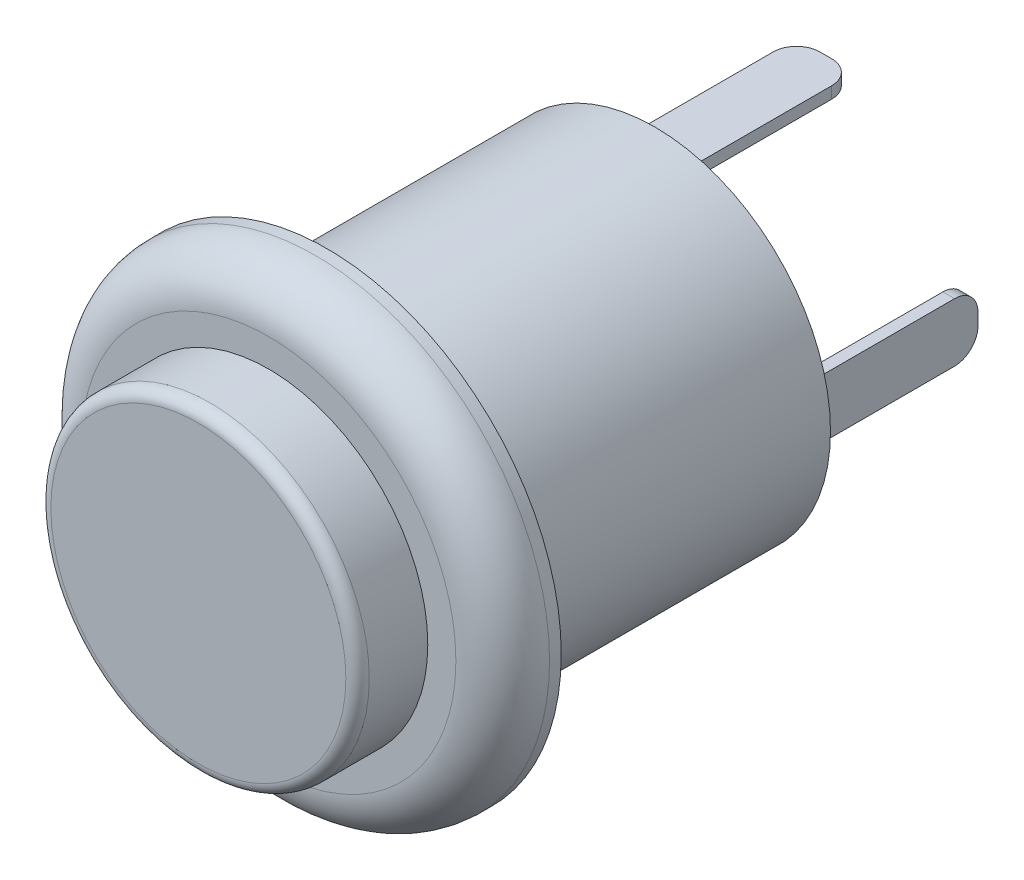
ISO-10303-21;
HEADER;
FILE_DESCRIPTION(('STEP AP214'),'2;1');
FILE_NAME('part.step','',(''),(''),'','','');
FILE_SCHEMA(('AUTOMOTIVE_DESIGN { 1 0 10303 214 1 1 1 1 }'));
ENDSEC;
DATA;
#1=APPLICATION_CONTEXT('core data for automotive mechanical design processes');
#2=APPLICATION_PROTOCOL_DEFINITION('international standard','automotive_design',2000,#1);
#3=PRODUCT_CONTEXT('',#1,'mechanical');
#4=PRODUCT('Part','Part','',(#3));
#5=PRODUCT_RELATED_PRODUCT_CATEGORY('part','',(#4));
#6=PRODUCT_DEFINITION_FORMATION('','',#4);
#7=PRODUCT_DEFINITION_CONTEXT('part definition',#1,'design');
#8=PRODUCT_DEFINITION('design','',#6,#7);
#9=PRODUCT_DEFINITION_SHAPE('','',#8);
#10=(LENGTH_UNIT() NAMED_UNIT(*) SI_UNIT(.MILLI.,.METRE.));
#11=(NAMED_UNIT(*) PLANE_ANGLE_UNIT() SI_UNIT($,.RADIAN.));
#12=(NAMED_UNIT(*) SI_UNIT($,.STERADIAN.) SOLID_ANGLE_UNIT());
#13=UNCERTAINTY_MEASURE_WITH_UNIT(LENGTH_MEASURE(1.E-05),#10,'distance_accuracy_value','');
#14=(GEOMETRIC_REPRESENTATION_CONTEXT(3) GLOBAL_UNCERTAINTY_ASSIGNED_CONTEXT((#13)) GLOBAL_UNIT_ASSIGNED_CONTEXT((#10,
#11,#12)) REPRESENTATION_CONTEXT('',''));
#15=CARTESIAN_POINT('',(0.,0.,0.));
#16=DIRECTION('',(0.,0.,1.));
#17=DIRECTION('',(1.,0.,0.));
#18=AXIS2_PLACEMENT_3D('',#15,#16,#17);
#19=CARTESIAN_POINT('',(0.,0.,0.));
#20=DIRECTION('',(0.,0.,1.));
#21=DIRECTION('',(1.,0.,0.));
#22=AXIS2_PLACEMENT_3D('',#19,#20,#21);
#23=PLANE('',#22);
#24=DIRECTION('',(0.,1.,0.));
#25=VECTOR('',#24,1.);
#26=CARTESIAN_POINT('',(-1.25,6.5,0.));
#27=LINE('',#26,#25);
#28=CARTESIAN_POINT('',(-1.25,6.,0.));
#29=VERTEX_POINT('',#28);
#30=CARTESIAN_POINT('',(-1.25,6.5,0.));
#31=VERTEX_POINT('',#30);
#32=EDGE_CURVE('E233',#29,#31,#27,.T.);
#33=ORIENTED_EDGE('',*,*,#32,.F.);
#34=DIRECTION('',(-1.,0.,0.));
#35=VECTOR('',#34,1.);
#36=CARTESIAN_POINT('',(1.25,6.,0.));
#37=LINE('',#36,#35);
#38=CARTESIAN_POINT('',(1.25,6.,0.));
#39=VERTEX_POINT('',#38);
#40=EDGE_CURVE('E238',#39,#29,#37,.T.);
#41=ORIENTED_EDGE('',*,*,#40,.F.);
#42=DIRECTION('',(0.,-1.,0.));
#43=VECTOR('',#42,1.);
#44=CARTESIAN_POINT('',(1.25,6.5,0.));
#45=LINE('',#44,#43);
#46=CARTESIAN_POINT('',(1.25,6.5,0.));
#47=VERTEX_POINT('',#46);
#48=EDGE_CURVE('E247',#47,#39,#45,.T.);
#49=ORIENTED_EDGE('',*,*,#48,.F.);
#50=DIRECTION('',(1.,0.,0.));
#51=VECTOR('',#50,1.);
#52=CARTESIAN_POINT('',(1.25,6.5,0.));
#53=LINE('',#52,#51);
#54=EDGE_CURVE('E244',#31,#47,#53,.T.);
#55=ORIENTED_EDGE('',*,*,#54,.F.);
#56=EDGE_LOOP('',(#33,#41,#49,#55));
#57=FACE_BOUND('',#56,.T.);
#58=DIRECTION('',(0.,1.,0.));
#59=VECTOR('',#58,1.);
#60=CARTESIAN_POINT('',(6.,1.25,0.));
#61=LINE('',#60,#59);
#62=CARTESIAN_POINT('',(6.,-1.25,0.));
#63=VERTEX_POINT('',#62);
#64=CARTESIAN_POINT('',(6.,1.25,0.));
#65=VERTEX_POINT('',#64);
#66=EDGE_CURVE('E285',#63,#65,#61,.T.);
#67=ORIENTED_EDGE('',*,*,#66,.F.);
#68=DIRECTION('',(-1.,0.,0.));
#69=VECTOR('',#68,1.);
#70=CARTESIAN_POINT('',(6.5,-1.25,0.));
#71=LINE('',#70,#69);
#72=CARTESIAN_POINT('',(6.5,-1.25,0.));
#73=VERTEX_POINT('',#72);
#74=EDGE_CURVE('E290',#73,#63,#71,.T.);
#75=ORIENTED_EDGE('',*,*,#74,.F.);
#76=DIRECTION('',(0.,-1.,0.));
#77=VECTOR('',#76,1.);
#78=CARTESIAN_POINT('',(6.5,1.25,0.));
#79=LINE('',#78,#77);
#80=CARTESIAN_POINT('',(6.5,1.25,0.));
#81=VERTEX_POINT('',#80);
#82=EDGE_CURVE('E299',#81,#73,#79,.T.);
#83=ORIENTED_EDGE('',*,*,#82,.F.);
#84=DIRECTION('',(1.,0.,0.));
#85=VECTOR('',#84,1.);
#86=CARTESIAN_POINT('',(6.5,1.25,0.));
#87=LINE('',#86,#85);
#88=EDGE_CURVE('E296',#65,#81,#87,.T.);
#89=ORIENTED_EDGE('',*,*,#88,.F.);
#90=EDGE_LOOP('',(#67,#75,#83,#89));
#91=FACE_BOUND('',#90,.T.);
#92=CARTESIAN_POINT('',(0.,0.,0.));
#93=DIRECTION('',(0.,0.,1.));
#94=DIRECTION('',(1.,0.,0.));
#95=AXIS2_PLACEMENT_3D('',#92,#93,#94);
#96=CIRCLE('',#95,7.5);
#97=CARTESIAN_POINT('',(7.5,0.,0.));
#98=VERTEX_POINT('',#97);
#99=EDGE_CURVE('E319',#98,#98,#96,.T.);
#100=ORIENTED_EDGE('',*,*,#99,.F.);
#101=EDGE_LOOP('',(#100));
#102=FACE_BOUND('',#101,.T.);
#103=DIRECTION('',(0.,-1.,0.));
#104=VECTOR('',#103,1.);
#105=CARTESIAN_POINT('',(-6.,1.25,0.));
#106=LINE('',#105,#104);
#107=CARTESIAN_POINT('',(-6.,1.25,0.));
#108=VERTEX_POINT('',#107);
#109=CARTESIAN_POINT('',(-6.,-1.25,0.));
#110=VERTEX_POINT('',#109);
#111=EDGE_CURVE('E259',#108,#110,#106,.T.);
#112=ORIENTED_EDGE('',*,*,#111,.F.);
#113=DIRECTION('',(1.,0.,0.));
#114=VECTOR('',#113,1.);
#115=CARTESIAN_POINT('',(-6.5,1.25,0.));
#116=LINE('',#115,#114);
#117=CARTESIAN_POINT('',(-6.5,1.25,0.));
#118=VERTEX_POINT('',#117);
#119=EDGE_CURVE('E264',#118,#108,#116,.T.);
#120=ORIENTED_EDGE('',*,*,#119,.F.);
#121=DIRECTION('',(0.,1.,0.));
#122=VECTOR('',#121,1.);
#123=CARTESIAN_POINT('',(-6.5,1.25,0.));
#124=LINE('',#123,#122);
#125=CARTESIAN_POINT('',(-6.5,-1.25,0.));
#126=VERTEX_POINT('',#125);
#127=EDGE_CURVE('E273',#126,#118,#124,.T.);
#128=ORIENTED_EDGE('',*,*,#127,.F.);
#129=DIRECTION('',(-1.,0.,0.));
#130=VECTOR('',#129,1.);
#131=CARTESIAN_POINT('',(-6.5,-1.25,0.));
#132=LINE('',#131,#130);
#133=EDGE_CURVE('E270',#110,#126,#132,.T.);
#134=ORIENTED_EDGE('',*,*,#133,.F.);
#135=EDGE_LOOP('',(#112,#120,#128,#134));
#136=FACE_BOUND('',#135,.T.);
#137=DIRECTION('',(0.,1.,0.));
#138=VECTOR('',#137,1.);
#139=CARTESIAN_POINT('',(-1.25,-6.,0.));
#140=LINE('',#139,#138);
#141=CARTESIAN_POINT('',(-1.25,-6.5,0.));
#142=VERTEX_POINT('',#141);
#143=CARTESIAN_POINT('',(-1.25,-6.,0.));
#144=VERTEX_POINT('',#143);
#145=EDGE_CURVE('E200',#142,#144,#140,.T.);
#146=ORIENTED_EDGE('',*,*,#145,.F.);
#147=DIRECTION('',(-1.,0.,0.));
#148=VECTOR('',#147,1.);
#149=CARTESIAN_POINT('',(1.25,-6.5,0.));
#150=LINE('',#149,#148);
#151=CARTESIAN_POINT('',(1.25,-6.5,0.));
#152=VERTEX_POINT('',#151);
#153=EDGE_CURVE('E213',#152,#142,#150,.T.);
#154=ORIENTED_EDGE('',*,*,#153,.F.);
#155=DIRECTION('',(0.,-1.,0.));
#156=VECTOR('',#155,1.);
#157=CARTESIAN_POINT('',(1.25,-6.,0.));
#158=LINE('',#157,#156);
#159=CARTESIAN_POINT('',(1.25,-6.,0.));
#160=VERTEX_POINT('',#159);
#161=EDGE_CURVE('E221',#160,#152,#158,.T.);
#162=ORIENTED_EDGE('',*,*,#161,.F.);
#163=DIRECTION('',(1.,0.,0.));
#164=VECTOR('',#163,1.);
#165=CARTESIAN_POINT('',(1.25,-6.,0.));
#166=LINE('',#165,#164);
#167=EDGE_CURVE('E216',#144,#160,#166,.T.);
#168=ORIENTED_EDGE('',*,*,#167,.F.);
#169=EDGE_LOOP('',(#146,#154,#162,#168));
#170=FACE_BOUND('',#169,.T.);
#171=ADVANCED_FACE('F34',(#57,#91,#102,#136,#170),#23,.F.);
#172=CARTESIAN_POINT('',(0.,0.,14.));
#173=DIRECTION('',(0.,0.,-1.));
#174=DIRECTION('',(-1.,0.,0.));
#175=AXIS2_PLACEMENT_3D('',#172,#173,#174);
#176=CYLINDRICAL_SURFACE('',#175,7.5);
#177=CARTESIAN_POINT('',(0.,0.,14.));
#178=DIRECTION('',(0.,0.,1.));
#179=DIRECTION('',(1.,0.,0.));
#180=AXIS2_PLACEMENT_3D('',#177,#178,#179);
#181=CIRCLE('',#180,7.5);
#182=CARTESIAN_POINT('',(7.5,0.,14.));
#183=VERTEX_POINT('',#182);
#184=EDGE_CURVE('E316',#183,#183,#181,.T.);
#185=ORIENTED_EDGE('',*,*,#184,.F.);
#186=EDGE_LOOP('',(#185));
#187=FACE_BOUND('',#186,.T.);
#188=ORIENTED_EDGE('',*,*,#99,.T.);
#189=EDGE_LOOP('',(#188));
#190=FACE_BOUND('',#189,.T.);
#191=ADVANCED_FACE('F413',(#187,#190),#176,.T.);
#192=CARTESIAN_POINT('',(0.,0.,16.5));
#193=DIRECTION('',(0.,0.,-1.));
#194=DIRECTION('',(-1.,0.,0.));
#195=AXIS2_PLACEMENT_3D('',#192,#193,#194);
#196=CYLINDRICAL_SURFACE('',#195,10.);
#197=CARTESIAN_POINT('',(0.,0.,14.5));
#198=DIRECTION('',(0.,0.,1.));
#199=DIRECTION('',(1.,0.,0.));
#200=AXIS2_PLACEMENT_3D('',#197,#198,#199);
#201=CIRCLE('',#200,10.);
#202=CARTESIAN_POINT('',(10.,0.,14.5));
#203=VERTEX_POINT('',#202);
#204=EDGE_CURVE('E11',#203,#203,#201,.F.);
#205=ORIENTED_EDGE('',*,*,#204,.T.);
#206=EDGE_LOOP('',(#205));
#207=FACE_BOUND('',#206,.T.);
#208=CARTESIAN_POINT('',(0.,0.,14.));
#209=DIRECTION('',(0.,0.,1.));
#210=DIRECTION('',(1.,0.,0.));
#211=AXIS2_PLACEMENT_3D('',#208,#209,#210);
#212=CIRCLE('',#211,10.);
#213=CARTESIAN_POINT('',(10.,0.,14.));
#214=VERTEX_POINT('',#213);
#215=EDGE_CURVE('E311',#214,#214,#212,.T.);
#216=ORIENTED_EDGE('',*,*,#215,.T.);
#217=EDGE_LOOP('',(#216));
#218=FACE_BOUND('',#217,.T.);
#219=ADVANCED_FACE('F419',(#207,#218),#196,.T.);
#220=CARTESIAN_POINT('',(0.,0.,16.5));
#221=DIRECTION('',(0.,0.,1.));
#222=DIRECTION('',(1.,0.,0.));
#223=AXIS2_PLACEMENT_3D('',#220,#221,#222);
#224=PLANE('',#223);
#225=CARTESIAN_POINT('',(0.,0.,16.5));
#226=DIRECTION('',(0.,0.,1.));
#227=DIRECTION('',(1.,0.,0.));
#228=AXIS2_PLACEMENT_3D('',#225,#226,#227);
#229=CIRCLE('',#228,8.);
#230=CARTESIAN_POINT('',(8.,0.,16.5));
#231=VERTEX_POINT('',#230);
#232=EDGE_CURVE('E42',#231,#231,#229,.T.);
#233=ORIENTED_EDGE('',*,*,#232,.T.);
#234=EDGE_LOOP('',(#233));
#235=FACE_BOUND('',#234,.T.);
#236=CARTESIAN_POINT('',(0.,0.,16.5));
#237=DIRECTION('',(0.,0.,1.));
#238=DIRECTION('',(1.,0.,0.));
#239=AXIS2_PLACEMENT_3D('',#236,#237,#238);
#240=CIRCLE('',#239,6.8);
#241=CARTESIAN_POINT('',(6.8,0.,16.5));
#242=VERTEX_POINT('',#241);
#243=EDGE_CURVE('E312',#242,#242,#240,.T.);
#244=ORIENTED_EDGE('',*,*,#243,.F.);
#245=EDGE_LOOP('',(#244));
#246=FACE_BOUND('',#245,.T.);
#247=ADVANCED_FACE('F400',(#235,#246),#224,.T.);
#248=CARTESIAN_POINT('',(0.,0.,14.));
#249=DIRECTION('',(0.,0.,1.));
#250=DIRECTION('',(1.,0.,0.));
#251=AXIS2_PLACEMENT_3D('',#248,#249,#250);
#252=PLANE('',#251);
#253=ORIENTED_EDGE('',*,*,#184,.T.);
#254=EDGE_LOOP('',(#253));
#255=FACE_BOUND('',#254,.T.);
#256=ORIENTED_EDGE('',*,*,#215,.F.);
#257=EDGE_LOOP('',(#256));
#258=FACE_BOUND('',#257,.T.);
#259=ADVANCED_FACE('F497',(#255,#258),#252,.F.);
#260=CARTESIAN_POINT('',(0.,0.,19.5));
#261=DIRECTION('',(0.,0.,-1.));
#262=DIRECTION('',(-1.,0.,0.));
#263=AXIS2_PLACEMENT_3D('',#260,#261,#262);
#264=CYLINDRICAL_SURFACE('',#263,6.8);
#265=CARTESIAN_POINT('',(0.,0.,19.));
#266=DIRECTION('',(0.,0.,1.));
#267=DIRECTION('',(1.,0.,0.));
#268=AXIS2_PLACEMENT_3D('',#265,#266,#267);
#269=CIRCLE('',#268,6.8);
#270=CARTESIAN_POINT('',(6.8,0.,19.));
#271=VERTEX_POINT('',#270);
#272=EDGE_CURVE('E395',#271,#271,#269,.F.);
#273=ORIENTED_EDGE('',*,*,#272,.T.);
#274=EDGE_LOOP('',(#273));
#275=FACE_BOUND('',#274,.T.);
#276=ORIENTED_EDGE('',*,*,#243,.T.);
#277=EDGE_LOOP('',(#276));
#278=FACE_BOUND('',#277,.T.);
#279=ADVANCED_FACE('F493',(#275,#278),#264,.T.);
#280=CARTESIAN_POINT('',(0.,0.,19.5));
#281=DIRECTION('',(0.,0.,1.));
#282=DIRECTION('',(1.,0.,0.));
#283=AXIS2_PLACEMENT_3D('',#280,#281,#282);
#284=PLANE('',#283);
#285=CARTESIAN_POINT('',(0.,0.,19.5));
#286=DIRECTION('',(0.,0.,1.));
#287=DIRECTION('',(1.,0.,0.));
#288=AXIS2_PLACEMENT_3D('',#285,#286,#287);
#289=CIRCLE('',#288,6.3);
#290=CARTESIAN_POINT('',(6.3,0.,19.5));
#291=VERTEX_POINT('',#290);
#292=EDGE_CURVE('E392',#291,#291,#289,.T.);
#293=ORIENTED_EDGE('',*,*,#292,.T.);
#294=EDGE_LOOP('',(#293));
#295=FACE_BOUND('',#294,.T.);
#296=ADVANCED_FACE('F487',(#295),#284,.T.);
#297=CARTESIAN_POINT('',(6.,1.25,-7.3));
#298=DIRECTION('',(1.,0.,0.));
#299=DIRECTION('',(0.,0.,-1.));
#300=AXIS2_PLACEMENT_3D('',#297,#298,#299);
#301=PLANE('',#300);
#302=DIRECTION('',(0.,1.,0.));
#303=VECTOR('',#302,1.);
#304=CARTESIAN_POINT('',(6.,1.25,-7.3));
#305=LINE('',#304,#303);
#306=CARTESIAN_POINT('',(6.,-0.250000000000001,-7.3));
#307=VERTEX_POINT('',#306);
#308=CARTESIAN_POINT('',(6.,0.249999999999999,-7.3));
#309=VERTEX_POINT('',#308);
#310=EDGE_CURVE('E286',#307,#309,#305,.T.);
#311=ORIENTED_EDGE('',*,*,#310,.F.);
#312=CARTESIAN_POINT('',(6.,-0.250000000000001,-6.3));
#313=DIRECTION('',(1.,0.,0.));
#314=DIRECTION('',(0.,0.,-1.));
#315=AXIS2_PLACEMENT_3D('',#312,#313,#314);
#316=CIRCLE('',#315,1.);
#317=CARTESIAN_POINT('',(6.,-1.25,-6.3));
#318=VERTEX_POINT('',#317);
#319=EDGE_CURVE('E384',#307,#318,#316,.F.);
#320=ORIENTED_EDGE('',*,*,#319,.T.);
#321=DIRECTION('',(0.,0.,1.));
#322=VECTOR('',#321,1.);
#323=CARTESIAN_POINT('',(6.,-1.25,-7.3));
#324=LINE('',#323,#322);
#325=EDGE_CURVE('E293',#318,#63,#324,.T.);
#326=ORIENTED_EDGE('',*,*,#325,.T.);
#327=ORIENTED_EDGE('',*,*,#66,.T.);
#328=DIRECTION('',(0.,0.,1.));
#329=VECTOR('',#328,1.);
#330=CARTESIAN_POINT('',(6.,1.25,-7.3));
#331=LINE('',#330,#329);
#332=CARTESIAN_POINT('',(6.,1.25,-6.3));
#333=VERTEX_POINT('',#332);
#334=EDGE_CURVE('E309',#333,#65,#331,.T.);
#335=ORIENTED_EDGE('',*,*,#334,.F.);
#336=CARTESIAN_POINT('',(6.,0.249999999999999,-6.3));
#337=DIRECTION('',(1.,0.,0.));
#338=DIRECTION('',(0.,0.,-1.));
#339=AXIS2_PLACEMENT_3D('',#336,#337,#338);
#340=CIRCLE('',#339,1.);
#341=EDGE_CURVE('E382',#333,#309,#340,.F.);
#342=ORIENTED_EDGE('',*,*,#341,.T.);
#343=EDGE_LOOP('',(#311,#320,#326,#327,#335,#342));
#344=FACE_BOUND('',#343,.T.);
#345=ADVANCED_FACE('F466',(#344),#301,.F.);
#346=CARTESIAN_POINT('',(6.5,1.25,-7.3));
#347=DIRECTION('',(0.,-1.,0.));
#348=DIRECTION('',(0.,0.,-1.));
#349=AXIS2_PLACEMENT_3D('',#346,#347,#348);
#350=PLANE('',#349);
#351=DIRECTION('',(0.,0.,1.));
#352=VECTOR('',#351,1.);
#353=CARTESIAN_POINT('',(6.5,1.25,-7.3));
#354=LINE('',#353,#352);
#355=CARTESIAN_POINT('',(6.5,1.25,-6.3));
#356=VERTEX_POINT('',#355);
#357=EDGE_CURVE('E307',#356,#81,#354,.T.);
#358=ORIENTED_EDGE('',*,*,#357,.F.);
#359=DIRECTION('',(1.,0.,0.));
#360=VECTOR('',#359,1.);
#361=CARTESIAN_POINT('',(6.,1.25,-6.3));
#362=LINE('',#361,#360);
#363=EDGE_CURVE('E390',#356,#333,#362,.F.);
#364=ORIENTED_EDGE('',*,*,#363,.T.);
#365=ORIENTED_EDGE('',*,*,#334,.T.);
#366=ORIENTED_EDGE('',*,*,#88,.T.);
#367=EDGE_LOOP('',(#358,#364,#365,#366));
#368=FACE_BOUND('',#367,.T.);
#369=ADVANCED_FACE('F479',(#368),#350,.F.);
#370=CARTESIAN_POINT('',(6.5,1.25,-7.3));
#371=DIRECTION('',(-1.,0.,0.));
#372=DIRECTION('',(0.,-1.,0.));
#373=AXIS2_PLACEMENT_3D('',#370,#371,#372);
#374=PLANE('',#373);
#375=DIRECTION('',(0.,0.,1.));
#376=VECTOR('',#375,1.);
#377=CARTESIAN_POINT('',(6.5,-1.25,-7.3));
#378=LINE('',#377,#376);
#379=CARTESIAN_POINT('',(6.5,-1.25,-6.3));
#380=VERTEX_POINT('',#379);
#381=EDGE_CURVE('E305',#380,#73,#378,.T.);
#382=ORIENTED_EDGE('',*,*,#381,.F.);
#383=CARTESIAN_POINT('',(6.5,-0.250000000000001,-6.3));
#384=DIRECTION('',(-1.,0.,0.));
#385=DIRECTION('',(0.,-1.,0.));
#386=AXIS2_PLACEMENT_3D('',#383,#384,#385);
#387=CIRCLE('',#386,1.);
#388=CARTESIAN_POINT('',(6.5,-0.250000000000001,-7.3));
#389=VERTEX_POINT('',#388);
#390=EDGE_CURVE('E388',#380,#389,#387,.F.);
#391=ORIENTED_EDGE('',*,*,#390,.T.);
#392=DIRECTION('',(0.,-1.,0.));
#393=VECTOR('',#392,1.);
#394=CARTESIAN_POINT('',(6.5,1.25,-7.3));
#395=LINE('',#394,#393);
#396=CARTESIAN_POINT('',(6.5,0.249999999999999,-7.3));
#397=VERTEX_POINT('',#396);
#398=EDGE_CURVE('E289',#397,#389,#395,.T.);
#399=ORIENTED_EDGE('',*,*,#398,.F.);
#400=CARTESIAN_POINT('',(6.5,0.249999999999999,-6.3));
#401=DIRECTION('',(-1.,0.,0.));
#402=DIRECTION('',(0.,-1.,0.));
#403=AXIS2_PLACEMENT_3D('',#400,#401,#402);
#404=CIRCLE('',#403,1.);
#405=EDGE_CURVE('E49',#397,#356,#404,.F.);
#406=ORIENTED_EDGE('',*,*,#405,.T.);
#407=ORIENTED_EDGE('',*,*,#357,.T.);
#408=ORIENTED_EDGE('',*,*,#82,.T.);
#409=EDGE_LOOP('',(#382,#391,#399,#406,#407,#408));
#410=FACE_BOUND('',#409,.T.);
#411=ADVANCED_FACE('F477',(#410),#374,.F.);
#412=CARTESIAN_POINT('',(6.5,-1.25,-7.3));
#413=DIRECTION('',(0.,1.,0.));
#414=DIRECTION('',(0.,0.,1.));
#415=AXIS2_PLACEMENT_3D('',#412,#413,#414);
#416=PLANE('',#415);
#417=ORIENTED_EDGE('',*,*,#325,.F.);
#418=DIRECTION('',(-1.,0.,0.));
#419=VECTOR('',#418,1.);
#420=CARTESIAN_POINT('',(6.5,-1.25,-6.3));
#421=LINE('',#420,#419);
#422=EDGE_CURVE('E57',#318,#380,#421,.F.);
#423=ORIENTED_EDGE('',*,*,#422,.T.);
#424=ORIENTED_EDGE('',*,*,#381,.T.);
#425=ORIENTED_EDGE('',*,*,#74,.T.);
#426=EDGE_LOOP('',(#417,#423,#424,#425));
#427=FACE_BOUND('',#426,.T.);
#428=ADVANCED_FACE('F472',(#427),#416,.F.);
#429=CARTESIAN_POINT('',(0.,0.,-7.3));
#430=DIRECTION('',(0.,0.,-1.));
#431=DIRECTION('',(-1.,0.,0.));
#432=AXIS2_PLACEMENT_3D('',#429,#430,#431);
#433=PLANE('',#432);
#434=ORIENTED_EDGE('',*,*,#398,.T.);
#435=DIRECTION('',(-1.,0.,0.));
#436=VECTOR('',#435,1.);
#437=CARTESIAN_POINT('',(6.,-0.250000000000001,-7.3));
#438=LINE('',#437,#436);
#439=EDGE_CURVE('E379',#389,#307,#438,.T.);
#440=ORIENTED_EDGE('',*,*,#439,.T.);
#441=ORIENTED_EDGE('',*,*,#310,.T.);
#442=DIRECTION('',(1.,0.,0.));
#443=VECTOR('',#442,1.);
#444=CARTESIAN_POINT('',(6.5,0.249999999999999,-7.3));
#445=LINE('',#444,#443);
#446=EDGE_CURVE('E376',#309,#397,#445,.T.);
#447=ORIENTED_EDGE('',*,*,#446,.T.);
#448=EDGE_LOOP('',(#434,#440,#441,#447));
#449=FACE_BOUND('',#448,.T.);
#450=ADVANCED_FACE('F468',(#449),#433,.T.);
#451=CARTESIAN_POINT('',(-6.,1.25,-7.3));
#452=DIRECTION('',(-1.,0.,0.));
#453=DIRECTION('',(0.,0.,1.));
#454=AXIS2_PLACEMENT_3D('',#451,#452,#453);
#455=PLANE('',#454);
#456=DIRECTION('',(0.,-1.,0.));
#457=VECTOR('',#456,1.);
#458=CARTESIAN_POINT('',(-6.,1.25,-7.3));
#459=LINE('',#458,#457);
#460=CARTESIAN_POINT('',(-6.,0.250000000000002,-7.3));
#461=VERTEX_POINT('',#460);
#462=CARTESIAN_POINT('',(-6.,-0.249999999999998,-7.3));
#463=VERTEX_POINT('',#462);
#464=EDGE_CURVE('E260',#461,#463,#459,.T.);
#465=ORIENTED_EDGE('',*,*,#464,.F.);
#466=CARTESIAN_POINT('',(-6.,0.250000000000002,-6.3));
#467=DIRECTION('',(-1.,0.,0.));
#468=DIRECTION('',(0.,0.,1.));
#469=AXIS2_PLACEMENT_3D('',#466,#467,#468);
#470=CIRCLE('',#469,1.);
#471=CARTESIAN_POINT('',(-6.,1.25,-6.3));
#472=VERTEX_POINT('',#471);
#473=EDGE_CURVE('E349',#461,#472,#470,.F.);
#474=ORIENTED_EDGE('',*,*,#473,.T.);
#475=DIRECTION('',(0.,0.,1.));
#476=VECTOR('',#475,1.);
#477=CARTESIAN_POINT('',(-6.,1.25,-7.3));
#478=LINE('',#477,#476);
#479=EDGE_CURVE('E267',#472,#108,#478,.T.);
#480=ORIENTED_EDGE('',*,*,#479,.T.);
#481=ORIENTED_EDGE('',*,*,#111,.T.);
#482=DIRECTION('',(0.,0.,1.));
#483=VECTOR('',#482,1.);
#484=CARTESIAN_POINT('',(-6.,-1.25,-7.3));
#485=LINE('',#484,#483);
#486=CARTESIAN_POINT('',(-6.,-1.25,-6.3));
#487=VERTEX_POINT('',#486);
#488=EDGE_CURVE('E283',#487,#110,#485,.T.);
#489=ORIENTED_EDGE('',*,*,#488,.F.);
#490=CARTESIAN_POINT('',(-6.,-0.249999999999998,-6.3));
#491=DIRECTION('',(-1.,0.,0.));
#492=DIRECTION('',(0.,0.,1.));
#493=AXIS2_PLACEMENT_3D('',#490,#491,#492);
#494=CIRCLE('',#493,1.);
#495=EDGE_CURVE('E347',#487,#463,#494,.F.);
#496=ORIENTED_EDGE('',*,*,#495,.T.);
#497=EDGE_LOOP('',(#465,#474,#480,#481,#489,#496));
#498=FACE_BOUND('',#497,.T.);
#499=ADVANCED_FACE('F692',(#498),#455,.F.);
#500=CARTESIAN_POINT('',(-6.5,-1.25,-7.3));
#501=DIRECTION('',(0.,1.,0.));
#502=DIRECTION('',(-1.,0.,0.));
#503=AXIS2_PLACEMENT_3D('',#500,#501,#502);
#504=PLANE('',#503);
#505=DIRECTION('',(0.,0.,1.));
#506=VECTOR('',#505,1.);
#507=CARTESIAN_POINT('',(-6.5,-1.25,-7.3));
#508=LINE('',#507,#506);
#509=CARTESIAN_POINT('',(-6.5,-1.25,-6.3));
#510=VERTEX_POINT('',#509);
#511=EDGE_CURVE('E281',#510,#126,#508,.T.);
#512=ORIENTED_EDGE('',*,*,#511,.F.);
#513=DIRECTION('',(-1.,0.,0.));
#514=VECTOR('',#513,1.);
#515=CARTESIAN_POINT('',(-6.5,-1.25,-6.3));
#516=LINE('',#515,#514);
#517=EDGE_CURVE('E357',#510,#487,#516,.F.);
#518=ORIENTED_EDGE('',*,*,#517,.T.);
#519=ORIENTED_EDGE('',*,*,#488,.T.);
#520=ORIENTED_EDGE('',*,*,#133,.T.);
#521=EDGE_LOOP('',(#512,#518,#519,#520));
#522=FACE_BOUND('',#521,.T.);
#523=ADVANCED_FACE('F683',(#522),#504,.F.);
#524=CARTESIAN_POINT('',(-6.5,1.25,-7.3));
#525=DIRECTION('',(1.,0.,0.));
#526=DIRECTION('',(0.,0.,-1.));
#527=AXIS2_PLACEMENT_3D('',#524,#525,#526);
#528=PLANE('',#527);
#529=DIRECTION('',(0.,0.,1.));
#530=VECTOR('',#529,1.);
#531=CARTESIAN_POINT('',(-6.5,1.25,-7.3));
#532=LINE('',#531,#530);
#533=CARTESIAN_POINT('',(-6.5,1.25,-6.3));
#534=VERTEX_POINT('',#533);
#535=EDGE_CURVE('E279',#534,#118,#532,.T.);
#536=ORIENTED_EDGE('',*,*,#535,.F.);
#537=CARTESIAN_POINT('',(-6.5,0.250000000000002,-6.3));
#538=DIRECTION('',(1.,0.,0.));
#539=DIRECTION('',(0.,0.,-1.));
#540=AXIS2_PLACEMENT_3D('',#537,#538,#539);
#541=CIRCLE('',#540,1.);
#542=CARTESIAN_POINT('',(-6.5,0.250000000000002,-7.3));
#543=VERTEX_POINT('',#542);
#544=EDGE_CURVE('E355',#534,#543,#541,.F.);
#545=ORIENTED_EDGE('',*,*,#544,.T.);
#546=DIRECTION('',(0.,1.,0.));
#547=VECTOR('',#546,1.);
#548=CARTESIAN_POINT('',(-6.5,1.25,-7.3));
#549=LINE('',#548,#547);
#550=CARTESIAN_POINT('',(-6.5,-0.249999999999998,-7.3));
#551=VERTEX_POINT('',#550);
#552=EDGE_CURVE('E263',#551,#543,#549,.T.);
#553=ORIENTED_EDGE('',*,*,#552,.F.);
#554=CARTESIAN_POINT('',(-6.5,-0.249999999999998,-6.3));
#555=DIRECTION('',(1.,0.,0.));
#556=DIRECTION('',(0.,0.,-1.));
#557=AXIS2_PLACEMENT_3D('',#554,#555,#556);
#558=CIRCLE('',#557,1.);
#559=EDGE_CURVE('E353',#551,#510,#558,.F.);
#560=ORIENTED_EDGE('',*,*,#559,.T.);
#561=ORIENTED_EDGE('',*,*,#511,.T.);
#562=ORIENTED_EDGE('',*,*,#127,.T.);
#563=EDGE_LOOP('',(#536,#545,#553,#560,#561,#562));
#564=FACE_BOUND('',#563,.T.);
#565=ADVANCED_FACE('F674',(#564),#528,.F.);
#566=CARTESIAN_POINT('',(-6.5,1.25,-7.3));
#567=DIRECTION('',(0.,-1.,0.));
#568=DIRECTION('',(0.,0.,-1.));
#569=AXIS2_PLACEMENT_3D('',#566,#567,#568);
#570=PLANE('',#569);
#571=ORIENTED_EDGE('',*,*,#479,.F.);
#572=DIRECTION('',(1.,0.,0.));
#573=VECTOR('',#572,1.);
#574=CARTESIAN_POINT('',(-6.5,1.25,-6.3));
#575=LINE('',#574,#573);
#576=EDGE_CURVE('E351',#472,#534,#575,.F.);
#577=ORIENTED_EDGE('',*,*,#576,.T.);
#578=ORIENTED_EDGE('',*,*,#535,.T.);
#579=ORIENTED_EDGE('',*,*,#119,.T.);
#580=EDGE_LOOP('',(#571,#577,#578,#579));
#581=FACE_BOUND('',#580,.T.);
#582=ADVANCED_FACE('F665',(#581),#570,.F.);
#583=CARTESIAN_POINT('',(0.,0.,-7.3));
#584=DIRECTION('',(0.,0.,1.));
#585=DIRECTION('',(1.,0.,0.));
#586=AXIS2_PLACEMENT_3D('',#583,#584,#585);
#587=PLANE('',#586);
#588=ORIENTED_EDGE('',*,*,#552,.T.);
#589=DIRECTION('',(1.,0.,0.));
#590=VECTOR('',#589,1.);
#591=CARTESIAN_POINT('',(0.,0.250000000000002,-7.3));
#592=LINE('',#591,#590);
#593=EDGE_CURVE('E344',#543,#461,#592,.T.);
#594=ORIENTED_EDGE('',*,*,#593,.T.);
#595=ORIENTED_EDGE('',*,*,#464,.T.);
#596=DIRECTION('',(-1.,0.,0.));
#597=VECTOR('',#596,1.);
#598=CARTESIAN_POINT('',(0.,-0.25,-7.3));
#599=LINE('',#598,#597);
#600=EDGE_CURVE('E341',#463,#551,#599,.T.);
#601=ORIENTED_EDGE('',*,*,#600,.T.);
#602=EDGE_LOOP('',(#588,#594,#595,#601));
#603=FACE_BOUND('',#602,.T.);
#604=ADVANCED_FACE('F656',(#603),#587,.F.);
#605=CARTESIAN_POINT('',(-1.25,6.5,-7.3));
#606=DIRECTION('',(1.,0.,0.));
#607=DIRECTION('',(0.,0.,-1.));
#608=AXIS2_PLACEMENT_3D('',#605,#606,#607);
#609=PLANE('',#608);
#610=DIRECTION('',(0.,0.,1.));
#611=VECTOR('',#610,1.);
#612=CARTESIAN_POINT('',(-1.25,6.5,-7.3));
#613=LINE('',#612,#611);
#614=CARTESIAN_POINT('',(-1.25,6.5,-6.3));
#615=VERTEX_POINT('',#614);
#616=EDGE_CURVE('E257',#615,#31,#613,.T.);
#617=ORIENTED_EDGE('',*,*,#616,.F.);
#618=DIRECTION('',(0.,1.,0.));
#619=VECTOR('',#618,1.);
#620=CARTESIAN_POINT('',(-1.25,6.,-6.3));
#621=LINE('',#620,#619);
#622=CARTESIAN_POINT('',(-1.25,6.,-6.3));
#623=VERTEX_POINT('',#622);
#624=EDGE_CURVE('E333',#615,#623,#621,.F.);
#625=ORIENTED_EDGE('',*,*,#624,.T.);
#626=DIRECTION('',(0.,0.,1.));
#627=VECTOR('',#626,1.);
#628=CARTESIAN_POINT('',(-1.25,6.,-7.3));
#629=LINE('',#628,#627);
#630=EDGE_CURVE('E241',#623,#29,#629,.T.);
#631=ORIENTED_EDGE('',*,*,#630,.T.);
#632=ORIENTED_EDGE('',*,*,#32,.T.);
#633=EDGE_LOOP('',(#617,#625,#631,#632));
#634=FACE_BOUND('',#633,.T.);
#635=ADVANCED_FACE('F647',(#634),#609,.F.);
#636=CARTESIAN_POINT('',(1.25,6.5,-7.3));
#637=DIRECTION('',(0.,-1.,0.));
#638=DIRECTION('',(0.,0.,-1.));
#639=AXIS2_PLACEMENT_3D('',#636,#637,#638);
#640=PLANE('',#639);
#641=DIRECTION('',(1.,0.,0.));
#642=VECTOR('',#641,1.);
#643=CARTESIAN_POINT('',(1.25,6.5,-7.3));
#644=LINE('',#643,#642);
#645=CARTESIAN_POINT('',(-0.249999999999996,6.5,-7.3));
#646=VERTEX_POINT('',#645);
#647=CARTESIAN_POINT('',(0.250000000000004,6.5,-7.3));
#648=VERTEX_POINT('',#647);
#649=EDGE_CURVE('E234',#646,#648,#644,.T.);
#650=ORIENTED_EDGE('',*,*,#649,.F.);
#651=CARTESIAN_POINT('',(-0.249999999999996,6.5,-6.3));
#652=DIRECTION('',(0.,-1.,0.));
#653=DIRECTION('',(0.,0.,-1.));
#654=AXIS2_PLACEMENT_3D('',#651,#652,#653);
#655=CIRCLE('',#654,1.);
#656=EDGE_CURVE('E331',#646,#615,#655,.F.);
#657=ORIENTED_EDGE('',*,*,#656,.T.);
#658=ORIENTED_EDGE('',*,*,#616,.T.);
#659=ORIENTED_EDGE('',*,*,#54,.T.);
#660=DIRECTION('',(0.,0.,1.));
#661=VECTOR('',#660,1.);
#662=CARTESIAN_POINT('',(1.25,6.5,-7.3));
#663=LINE('',#662,#661);
#664=CARTESIAN_POINT('',(1.25,6.5,-6.3));
#665=VERTEX_POINT('',#664);
#666=EDGE_CURVE('E255',#665,#47,#663,.T.);
#667=ORIENTED_EDGE('',*,*,#666,.F.);
#668=CARTESIAN_POINT('',(0.250000000000004,6.5,-6.3));
#669=DIRECTION('',(0.,-1.,0.));
#670=DIRECTION('',(0.,0.,-1.));
#671=AXIS2_PLACEMENT_3D('',#668,#669,#670);
#672=CIRCLE('',#671,1.);
#673=EDGE_CURVE('E329',#665,#648,#672,.F.);
#674=ORIENTED_EDGE('',*,*,#673,.T.);
#675=EDGE_LOOP('',(#650,#657,#658,#659,#667,#674));
#676=FACE_BOUND('',#675,.T.);
#677=ADVANCED_FACE('F638',(#676),#640,.F.);
#678=CARTESIAN_POINT('',(1.25,6.5,-7.3));
#679=DIRECTION('',(-1.,0.,0.));
#680=DIRECTION('',(0.,-1.,0.));
#681=AXIS2_PLACEMENT_3D('',#678,#679,#680);
#682=PLANE('',#681);
#683=DIRECTION('',(0.,0.,1.));
#684=VECTOR('',#683,1.);
#685=CARTESIAN_POINT('',(1.25,6.,-7.3));
#686=LINE('',#685,#684);
#687=CARTESIAN_POINT('',(1.25,6.,-6.3));
#688=VERTEX_POINT('',#687);
#689=EDGE_CURVE('E253',#688,#39,#686,.T.);
#690=ORIENTED_EDGE('',*,*,#689,.F.);
#691=DIRECTION('',(0.,-1.,0.));
#692=VECTOR('',#691,1.);
#693=CARTESIAN_POINT('',(1.25,6.5,-6.3));
#694=LINE('',#693,#692);
#695=EDGE_CURVE('E339',#688,#665,#694,.F.);
#696=ORIENTED_EDGE('',*,*,#695,.T.);
#697=ORIENTED_EDGE('',*,*,#666,.T.);
#698=ORIENTED_EDGE('',*,*,#48,.T.);
#699=EDGE_LOOP('',(#690,#696,#697,#698));
#700=FACE_BOUND('',#699,.T.);
#701=ADVANCED_FACE('F629',(#700),#682,.F.);
#702=CARTESIAN_POINT('',(1.25,6.,-7.3));
#703=DIRECTION('',(0.,1.,0.));
#704=DIRECTION('',(0.,0.,1.));
#705=AXIS2_PLACEMENT_3D('',#702,#703,#704);
#706=PLANE('',#705);
#707=ORIENTED_EDGE('',*,*,#630,.F.);
#708=CARTESIAN_POINT('',(-0.249999999999996,6.,-6.3));
#709=DIRECTION('',(0.,1.,0.));
#710=DIRECTION('',(0.,0.,1.));
#711=AXIS2_PLACEMENT_3D('',#708,#709,#710);
#712=CIRCLE('',#711,1.);
#713=CARTESIAN_POINT('',(-0.249999999999996,6.,-7.3));
#714=VERTEX_POINT('',#713);
#715=EDGE_CURVE('E337',#623,#714,#712,.F.);
#716=ORIENTED_EDGE('',*,*,#715,.T.);
#717=DIRECTION('',(-1.,0.,0.));
#718=VECTOR('',#717,1.);
#719=CARTESIAN_POINT('',(1.25,6.,-7.3));
#720=LINE('',#719,#718);
#721=CARTESIAN_POINT('',(0.250000000000004,6.,-7.3));
#722=VERTEX_POINT('',#721);
#723=EDGE_CURVE('E237',#722,#714,#720,.T.);
#724=ORIENTED_EDGE('',*,*,#723,.F.);
#725=CARTESIAN_POINT('',(0.250000000000004,6.,-6.3));
#726=DIRECTION('',(0.,1.,0.));
#727=DIRECTION('',(0.,0.,1.));
#728=AXIS2_PLACEMENT_3D('',#725,#726,#727);
#729=CIRCLE('',#728,1.);
#730=EDGE_CURVE('E335',#722,#688,#729,.F.);
#731=ORIENTED_EDGE('',*,*,#730,.T.);
#732=ORIENTED_EDGE('',*,*,#689,.T.);
#733=ORIENTED_EDGE('',*,*,#40,.T.);
#734=EDGE_LOOP('',(#707,#716,#724,#731,#732,#733));
#735=FACE_BOUND('',#734,.T.);
#736=ADVANCED_FACE('F620',(#735),#706,.F.);
#737=CARTESIAN_POINT('',(0.,0.,-7.3));
#738=DIRECTION('',(0.,0.,-1.));
#739=DIRECTION('',(-1.,0.,0.));
#740=AXIS2_PLACEMENT_3D('',#737,#738,#739);
#741=PLANE('',#740);
#742=ORIENTED_EDGE('',*,*,#723,.T.);
#743=DIRECTION('',(0.,1.,0.));
#744=VECTOR('',#743,1.);
#745=CARTESIAN_POINT('',(-0.249999999999996,6.5,-7.3));
#746=LINE('',#745,#744);
#747=EDGE_CURVE('E326',#714,#646,#746,.T.);
#748=ORIENTED_EDGE('',*,*,#747,.T.);
#749=ORIENTED_EDGE('',*,*,#649,.T.);
#750=DIRECTION('',(0.,-1.,0.));
#751=VECTOR('',#750,1.);
#752=CARTESIAN_POINT('',(0.250000000000004,6.,-7.3));
#753=LINE('',#752,#751);
#754=EDGE_CURVE('E315',#648,#722,#753,.T.);
#755=ORIENTED_EDGE('',*,*,#754,.T.);
#756=EDGE_LOOP('',(#742,#748,#749,#755));
#757=FACE_BOUND('',#756,.T.);
#758=ADVANCED_FACE('F612',(#757),#741,.T.);
#759=CARTESIAN_POINT('',(-1.25,-6.,-7.3));
#760=DIRECTION('',(1.,0.,0.));
#761=DIRECTION('',(0.,1.,0.));
#762=AXIS2_PLACEMENT_3D('',#759,#760,#761);
#763=PLANE('',#762);
#764=DIRECTION('',(0.,0.,1.));
#765=VECTOR('',#764,1.);
#766=CARTESIAN_POINT('',(-1.25,-6.,-7.3));
#767=LINE('',#766,#765);
#768=CARTESIAN_POINT('',(-1.25,-6.,-6.3));
#769=VERTEX_POINT('',#768);
#770=EDGE_CURVE('E231',#769,#144,#767,.T.);
#771=ORIENTED_EDGE('',*,*,#770,.F.);
#772=DIRECTION('',(0.,1.,0.));
#773=VECTOR('',#772,1.);
#774=CARTESIAN_POINT('',(-1.25,-6.5,-6.3));
#775=LINE('',#774,#773);
#776=CARTESIAN_POINT('',(-1.25,-6.5,-6.3));
#777=VERTEX_POINT('',#776);
#778=EDGE_CURVE('E202',#769,#777,#775,.F.);
#779=ORIENTED_EDGE('',*,*,#778,.T.);
#780=DIRECTION('',(0.,0.,1.));
#781=VECTOR('',#780,1.);
#782=CARTESIAN_POINT('',(-1.25,-6.5,-7.3));
#783=LINE('',#782,#781);
#784=EDGE_CURVE('E196',#777,#142,#783,.T.);
#785=ORIENTED_EDGE('',*,*,#784,.T.);
#786=ORIENTED_EDGE('',*,*,#145,.T.);
#787=EDGE_LOOP('',(#771,#779,#785,#786));
#788=FACE_BOUND('',#787,.T.);
#789=ADVANCED_FACE('F199',(#788),#763,.F.);
#790=CARTESIAN_POINT('',(1.25,-6.,-7.3));
#791=DIRECTION('',(0.,-1.,0.));
#792=DIRECTION('',(0.,0.,-1.));
#793=AXIS2_PLACEMENT_3D('',#790,#791,#792);
#794=PLANE('',#793);
#795=DIRECTION('',(1.,0.,0.));
#796=VECTOR('',#795,1.);
#797=CARTESIAN_POINT('',(1.25,-6.,-7.3));
#798=LINE('',#797,#796);
#799=CARTESIAN_POINT('',(-0.249999999999996,-6.,-7.3));
#800=VERTEX_POINT('',#799);
#801=CARTESIAN_POINT('',(0.250000000000004,-6.,-7.3));
#802=VERTEX_POINT('',#801);
#803=EDGE_CURVE('E220',#800,#802,#798,.T.);
#804=ORIENTED_EDGE('',*,*,#803,.F.);
#805=CARTESIAN_POINT('',(-0.249999999999996,-6.,-6.3));
#806=DIRECTION('',(0.,-1.,0.));
#807=DIRECTION('',(0.,0.,-1.));
#808=AXIS2_PLACEMENT_3D('',#805,#806,#807);
#809=CIRCLE('',#808,1.);
#810=EDGE_CURVE('E367',#800,#769,#809,.F.);
#811=ORIENTED_EDGE('',*,*,#810,.T.);
#812=ORIENTED_EDGE('',*,*,#770,.T.);
#813=ORIENTED_EDGE('',*,*,#167,.T.);
#814=DIRECTION('',(0.,0.,1.));
#815=VECTOR('',#814,1.);
#816=CARTESIAN_POINT('',(1.25,-6.,-7.3));
#817=LINE('',#816,#815);
#818=CARTESIAN_POINT('',(1.25,-6.,-6.3));
#819=VERTEX_POINT('',#818);
#820=EDGE_CURVE('E229',#819,#160,#817,.T.);
#821=ORIENTED_EDGE('',*,*,#820,.F.);
#822=CARTESIAN_POINT('',(0.250000000000004,-6.,-6.3));
#823=DIRECTION('',(0.,-1.,0.));
#824=DIRECTION('',(0.,0.,-1.));
#825=AXIS2_PLACEMENT_3D('',#822,#823,#824);
#826=CIRCLE('',#825,1.);
#827=EDGE_CURVE('E365',#819,#802,#826,.F.);
#828=ORIENTED_EDGE('',*,*,#827,.T.);
#829=EDGE_LOOP('',(#804,#811,#812,#813,#821,#828));
#830=FACE_BOUND('',#829,.T.);
#831=ADVANCED_FACE('F595',(#830),#794,.F.);
#832=CARTESIAN_POINT('',(1.25,-6.,-7.3));
#833=DIRECTION('',(-1.,0.,0.));
#834=DIRECTION('',(0.,-1.,0.));
#835=AXIS2_PLACEMENT_3D('',#832,#833,#834);
#836=PLANE('',#835);
#837=DIRECTION('',(0.,0.,1.));
#838=VECTOR('',#837,1.);
#839=CARTESIAN_POINT('',(1.25,-6.5,-7.3));
#840=LINE('',#839,#838);
#841=CARTESIAN_POINT('',(1.25,-6.5,-6.3));
#842=VERTEX_POINT('',#841);
#843=EDGE_CURVE('E206',#842,#152,#840,.T.);
#844=ORIENTED_EDGE('',*,*,#843,.F.);
#845=DIRECTION('',(0.,-1.,0.));
#846=VECTOR('',#845,1.);
#847=CARTESIAN_POINT('',(1.25,-6.,-6.3));
#848=LINE('',#847,#846);
#849=EDGE_CURVE('E374',#842,#819,#848,.F.);
#850=ORIENTED_EDGE('',*,*,#849,.T.);
#851=ORIENTED_EDGE('',*,*,#820,.T.);
#852=ORIENTED_EDGE('',*,*,#161,.T.);
#853=EDGE_LOOP('',(#844,#850,#851,#852));
#854=FACE_BOUND('',#853,.T.);
#855=ADVANCED_FACE('F587',(#854),#836,.F.);
#856=CARTESIAN_POINT('',(1.25,-6.5,-7.3));
#857=DIRECTION('',(0.,1.,0.));
#858=DIRECTION('',(0.,0.,1.));
#859=AXIS2_PLACEMENT_3D('',#856,#857,#858);
#860=PLANE('',#859);
#861=ORIENTED_EDGE('',*,*,#784,.F.);
#862=CARTESIAN_POINT('',(-0.249999999999996,-6.5,-6.3));
#863=DIRECTION('',(0.,1.,0.));
#864=DIRECTION('',(0.,0.,1.));
#865=AXIS2_PLACEMENT_3D('',#862,#863,#864);
#866=CIRCLE('',#865,1.);
#867=CARTESIAN_POINT('',(-0.249999999999996,-6.5,-7.3));
#868=VERTEX_POINT('',#867);
#869=EDGE_CURVE('E372',#777,#868,#866,.F.);
#870=ORIENTED_EDGE('',*,*,#869,.T.);
#871=DIRECTION('',(-1.,0.,0.));
#872=VECTOR('',#871,1.);
#873=CARTESIAN_POINT('',(1.25,-6.5,-7.3));
#874=LINE('',#873,#872);
#875=CARTESIAN_POINT('',(0.250000000000004,-6.5,-7.3));
#876=VERTEX_POINT('',#875);
#877=EDGE_CURVE('E207',#876,#868,#874,.T.);
#878=ORIENTED_EDGE('',*,*,#877,.F.);
#879=CARTESIAN_POINT('',(0.250000000000004,-6.5,-6.3));
#880=DIRECTION('',(0.,1.,0.));
#881=DIRECTION('',(0.,0.,1.));
#882=AXIS2_PLACEMENT_3D('',#879,#880,#881);
#883=CIRCLE('',#882,1.);
#884=EDGE_CURVE('E370',#876,#842,#883,.F.);
#885=ORIENTED_EDGE('',*,*,#884,.T.);
#886=ORIENTED_EDGE('',*,*,#843,.T.);
#887=ORIENTED_EDGE('',*,*,#153,.T.);
#888=EDGE_LOOP('',(#861,#870,#878,#885,#886,#887));
#889=FACE_BOUND('',#888,.T.);
#890=ADVANCED_FACE('F218',(#889),#860,.F.);
#891=CARTESIAN_POINT('',(0.,0.,-7.3));
#892=DIRECTION('',(0.,0.,-1.));
#893=DIRECTION('',(-1.,0.,0.));
#894=AXIS2_PLACEMENT_3D('',#891,#892,#893);
#895=PLANE('',#894);
#896=ORIENTED_EDGE('',*,*,#877,.T.);
#897=DIRECTION('',(0.,1.,0.));
#898=VECTOR('',#897,1.);
#899=CARTESIAN_POINT('',(-0.249999999999996,-6.,-7.3));
#900=LINE('',#899,#898);
#901=EDGE_CURVE('E362',#868,#800,#900,.T.);
#902=ORIENTED_EDGE('',*,*,#901,.T.);
#903=ORIENTED_EDGE('',*,*,#803,.T.);
#904=DIRECTION('',(0.,-1.,0.));
#905=VECTOR('',#904,1.);
#906=CARTESIAN_POINT('',(0.250000000000004,-6.5,-7.3));
#907=LINE('',#906,#905);
#908=EDGE_CURVE('E359',#802,#876,#907,.T.);
#909=ORIENTED_EDGE('',*,*,#908,.T.);
#910=EDGE_LOOP('',(#896,#902,#903,#909));
#911=FACE_BOUND('',#910,.T.);
#912=ADVANCED_FACE('F431',(#911),#895,.T.);
#913=CARTESIAN_POINT('',(-0.249999999999996,0.,-6.3));
#914=DIRECTION('',(0.,-1.,0.));
#915=DIRECTION('',(0.,0.,-1.));
#916=AXIS2_PLACEMENT_3D('',#913,#914,#915);
#917=CYLINDRICAL_SURFACE('',#916,1.);
#918=ORIENTED_EDGE('',*,*,#715,.F.);
#919=ORIENTED_EDGE('',*,*,#624,.F.);
#920=ORIENTED_EDGE('',*,*,#656,.F.);
#921=ORIENTED_EDGE('',*,*,#747,.F.);
#922=EDGE_LOOP('',(#918,#919,#920,#921));
#923=FACE_BOUND('',#922,.T.);
#924=ADVANCED_FACE('F427',(#923),#917,.T.);
#925=CARTESIAN_POINT('',(0.249999999999999,0.,-6.3));
#926=DIRECTION('',(0.,1.,0.));
#927=DIRECTION('',(-1.,0.,0.));
#928=AXIS2_PLACEMENT_3D('',#925,#926,#927);
#929=CYLINDRICAL_SURFACE('',#928,1.);
#930=ORIENTED_EDGE('',*,*,#673,.F.);
#931=ORIENTED_EDGE('',*,*,#695,.F.);
#932=ORIENTED_EDGE('',*,*,#730,.F.);
#933=ORIENTED_EDGE('',*,*,#754,.F.);
#934=EDGE_LOOP('',(#930,#931,#932,#933));
#935=FACE_BOUND('',#934,.T.);
#936=ADVANCED_FACE('F430',(#935),#929,.T.);
#937=CARTESIAN_POINT('',(0.,0.250000000000002,-6.3));
#938=DIRECTION('',(1.,0.,0.));
#939=DIRECTION('',(0.,0.,-1.));
#940=AXIS2_PLACEMENT_3D('',#937,#938,#939);
#941=CYLINDRICAL_SURFACE('',#940,1.);
#942=ORIENTED_EDGE('',*,*,#544,.F.);
#943=ORIENTED_EDGE('',*,*,#576,.F.);
#944=ORIENTED_EDGE('',*,*,#473,.F.);
#945=ORIENTED_EDGE('',*,*,#593,.F.);
#946=EDGE_LOOP('',(#942,#943,#944,#945));
#947=FACE_BOUND('',#946,.T.);
#948=ADVANCED_FACE('F435',(#947),#941,.T.);
#949=CARTESIAN_POINT('',(0.,-0.25,-6.3));
#950=DIRECTION('',(-1.,0.,0.));
#951=DIRECTION('',(0.,-1.,0.));
#952=AXIS2_PLACEMENT_3D('',#949,#950,#951);
#953=CYLINDRICAL_SURFACE('',#952,1.);
#954=ORIENTED_EDGE('',*,*,#495,.F.);
#955=ORIENTED_EDGE('',*,*,#517,.F.);
#956=ORIENTED_EDGE('',*,*,#559,.F.);
#957=ORIENTED_EDGE('',*,*,#600,.F.);
#958=EDGE_LOOP('',(#954,#955,#956,#957));
#959=FACE_BOUND('',#958,.T.);
#960=ADVANCED_FACE('F439',(#959),#953,.T.);
#961=CARTESIAN_POINT('',(-0.249999999999993,0.,-6.3));
#962=DIRECTION('',(0.,-1.,0.));
#963=DIRECTION('',(1.,0.,0.));
#964=AXIS2_PLACEMENT_3D('',#961,#962,#963);
#965=CYLINDRICAL_SURFACE('',#964,1.);
#966=ORIENTED_EDGE('',*,*,#869,.F.);
#967=ORIENTED_EDGE('',*,*,#778,.F.);
#968=ORIENTED_EDGE('',*,*,#810,.F.);
#969=ORIENTED_EDGE('',*,*,#901,.F.);
#970=EDGE_LOOP('',(#966,#967,#968,#969));
#971=FACE_BOUND('',#970,.T.);
#972=ADVANCED_FACE('F443',(#971),#965,.T.);
#973=CARTESIAN_POINT('',(0.25000000000001,0.,-6.3));
#974=DIRECTION('',(0.,1.,0.));
#975=DIRECTION('',(-1.,0.,0.));
#976=AXIS2_PLACEMENT_3D('',#973,#974,#975);
#977=CYLINDRICAL_SURFACE('',#976,1.);
#978=ORIENTED_EDGE('',*,*,#827,.F.);
#979=ORIENTED_EDGE('',*,*,#849,.F.);
#980=ORIENTED_EDGE('',*,*,#884,.F.);
#981=ORIENTED_EDGE('',*,*,#908,.F.);
#982=EDGE_LOOP('',(#978,#979,#980,#981));
#983=FACE_BOUND('',#982,.T.);
#984=ADVANCED_FACE('F447',(#983),#977,.T.);
#985=CARTESIAN_POINT('',(0.,-0.250000000000001,-6.3));
#986=DIRECTION('',(1.,0.,0.));
#987=DIRECTION('',(0.,0.,-1.));
#988=AXIS2_PLACEMENT_3D('',#985,#986,#987);
#989=CYLINDRICAL_SURFACE('',#988,1.);
#990=ORIENTED_EDGE('',*,*,#390,.F.);
#991=ORIENTED_EDGE('',*,*,#422,.F.);
#992=ORIENTED_EDGE('',*,*,#319,.F.);
#993=ORIENTED_EDGE('',*,*,#439,.F.);
#994=EDGE_LOOP('',(#990,#991,#992,#993));
#995=FACE_BOUND('',#994,.T.);
#996=ADVANCED_FACE('F451',(#995),#989,.T.);
#997=CARTESIAN_POINT('',(0.,0.249999999999999,-6.3));
#998=DIRECTION('',(-1.,0.,0.));
#999=DIRECTION('',(0.,0.,1.));
#1000=AXIS2_PLACEMENT_3D('',#997,#998,#999);
#1001=CYLINDRICAL_SURFACE('',#1000,1.);
#1002=ORIENTED_EDGE('',*,*,#341,.F.);
#1003=ORIENTED_EDGE('',*,*,#363,.F.);
#1004=ORIENTED_EDGE('',*,*,#405,.F.);
#1005=ORIENTED_EDGE('',*,*,#446,.F.);
#1006=EDGE_LOOP('',(#1002,#1003,#1004,#1005));
#1007=FACE_BOUND('',#1006,.T.);
#1008=ADVANCED_FACE('F409',(#1007),#1001,.T.);
#1009=CARTESIAN_POINT('',(0.,0.,19.));
#1010=DIRECTION('',(0.,0.,1.));
#1011=DIRECTION('',(1.,0.,0.));
#1012=AXIS2_PLACEMENT_3D('',#1009,#1010,#1011);
#1013=TOROIDAL_SURFACE('',#1012,6.3,0.5);
#1014=ORIENTED_EDGE('',*,*,#272,.F.);
#1015=EDGE_LOOP('',(#1014));
#1016=FACE_BOUND('',#1015,.T.);
#1017=ORIENTED_EDGE('',*,*,#292,.F.);
#1018=EDGE_LOOP('',(#1017));
#1019=FACE_BOUND('',#1018,.T.);
#1020=ADVANCED_FACE('F404',(#1016,#1019),#1013,.T.);
#1021=CARTESIAN_POINT('',(0.,0.,14.5));
#1022=DIRECTION('',(0.,0.,1.));
#1023=DIRECTION('',(1.,0.,0.));
#1024=AXIS2_PLACEMENT_3D('',#1021,#1022,#1023);
#1025=TOROIDAL_SURFACE('',#1024,8.,2.);
#1026=ORIENTED_EDGE('',*,*,#204,.F.);
#1027=EDGE_LOOP('',(#1026));
#1028=FACE_BOUND('',#1027,.T.);
#1029=ORIENTED_EDGE('',*,*,#232,.F.);
#1030=EDGE_LOOP('',(#1029));
#1031=FACE_BOUND('',#1030,.T.);
#1032=ADVANCED_FACE('F36',(#1028,#1031),#1025,.T.);
#1033=CLOSED_SHELL('',(#171,#191,#219,#247,#259,#279,#296,#345,#369,#411,#428,#450,#499,#523,
#565,#582,#604,#635,#677,#701,#736,#758,#789,#831,#855,#890,#912,#924,#936,#948,#960,#972,#984,
#996,#1008,#1020,#1032));
#1034=MANIFOLD_SOLID_BREP('B2',#1033);
#1035=ADVANCED_BREP_SHAPE_REPRESENTATION('',(#18,#1034),#14);
#1036=SHAPE_DEFINITION_REPRESENTATION(#9,#1035);
ENDSEC;
END-ISO-10303-21;
